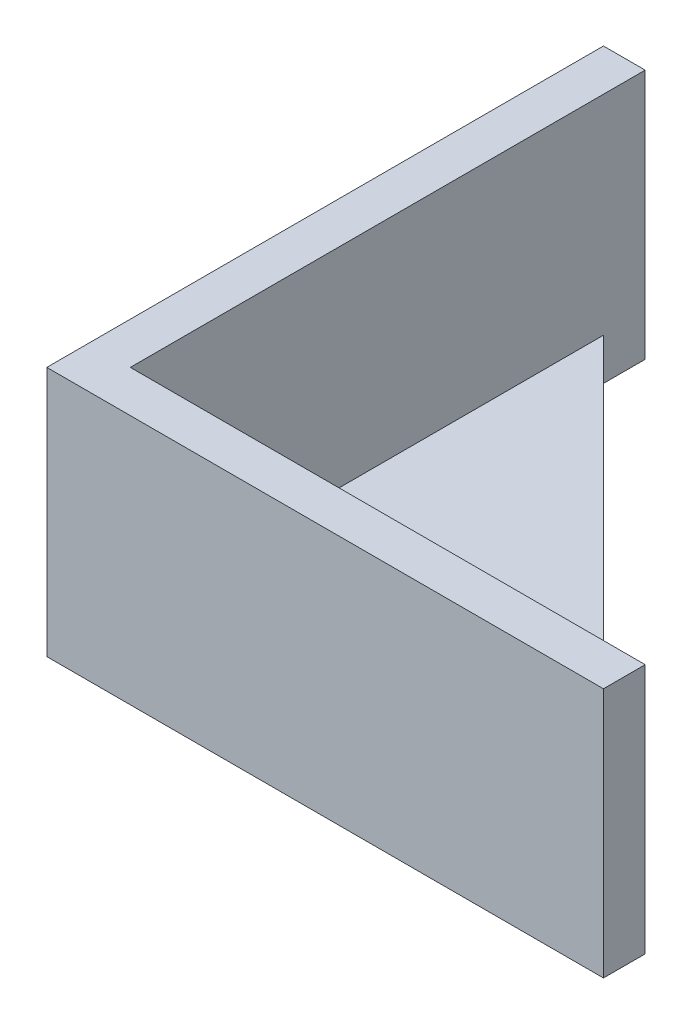
ISO-10303-21;
HEADER;
FILE_DESCRIPTION(('STEP AP214'),'2;1');
FILE_NAME('part.step','',(''),(''),'','','');
FILE_SCHEMA(('AUTOMOTIVE_DESIGN { 1 0 10303 214 1 1 1 1 }'));
ENDSEC;
DATA;
#1=APPLICATION_CONTEXT('core data for automotive mechanical design processes');
#2=APPLICATION_PROTOCOL_DEFINITION('international standard','automotive_design',2000,#1);
#3=PRODUCT_CONTEXT('',#1,'mechanical');
#4=PRODUCT('Part','Part','',(#3));
#5=PRODUCT_RELATED_PRODUCT_CATEGORY('part','',(#4));
#6=PRODUCT_DEFINITION_FORMATION('','',#4);
#7=PRODUCT_DEFINITION_CONTEXT('part definition',#1,'design');
#8=PRODUCT_DEFINITION('design','',#6,#7);
#9=PRODUCT_DEFINITION_SHAPE('','',#8);
#10=(LENGTH_UNIT() NAMED_UNIT(*) SI_UNIT(.MILLI.,.METRE.));
#11=(NAMED_UNIT(*) PLANE_ANGLE_UNIT() SI_UNIT($,.RADIAN.));
#12=(NAMED_UNIT(*) SI_UNIT($,.STERADIAN.) SOLID_ANGLE_UNIT());
#13=UNCERTAINTY_MEASURE_WITH_UNIT(LENGTH_MEASURE(1.E-05),#10,'distance_accuracy_value','');
#14=(GEOMETRIC_REPRESENTATION_CONTEXT(3) GLOBAL_UNCERTAINTY_ASSIGNED_CONTEXT((#13)) GLOBAL_UNIT_ASSIGNED_CONTEXT((#10,
#11,#12)) REPRESENTATION_CONTEXT('',''));
#15=CARTESIAN_POINT('',(0.,0.,0.));
#16=DIRECTION('',(0.,0.,1.));
#17=DIRECTION('',(1.,0.,0.));
#18=AXIS2_PLACEMENT_3D('',#15,#16,#17);
#19=CARTESIAN_POINT('',(0.,3.,0.));
#20=DIRECTION('',(0.,1.,0.));
#21=DIRECTION('',(0.,0.,1.));
#22=AXIS2_PLACEMENT_3D('',#19,#20,#21);
#23=PLANE('',#22);
#24=DIRECTION('',(0.707106781186548,0.,0.707106781186548));
#25=VECTOR('',#24,1.);
#26=CARTESIAN_POINT('',(20.,3.,-20.));
#27=LINE('',#26,#25);
#28=CARTESIAN_POINT('',(3.,3.,-37.));
#29=VERTEX_POINT('',#28);
#30=CARTESIAN_POINT('',(37.,3.,-2.99999999999999));
#31=VERTEX_POINT('',#30);
#32=EDGE_CURVE('E100',#29,#31,#27,.T.);
#33=ORIENTED_EDGE('',*,*,#32,.F.);
#34=DIRECTION('',(0.,0.,1.));
#35=VECTOR('',#34,1.);
#36=CARTESIAN_POINT('',(3.,3.,0.));
#37=LINE('',#36,#35);
#38=CARTESIAN_POINT('',(3.,3.,-2.99999999999999));
#39=VERTEX_POINT('',#38);
#40=EDGE_CURVE('E11',#29,#39,#37,.T.);
#41=ORIENTED_EDGE('',*,*,#40,.T.);
#42=DIRECTION('',(1.,0.,0.));
#43=VECTOR('',#42,1.);
#44=CARTESIAN_POINT('',(0.,3.,-3.));
#45=LINE('',#44,#43);
#46=EDGE_CURVE('E179',#39,#31,#45,.T.);
#47=ORIENTED_EDGE('',*,*,#46,.T.);
#48=EDGE_LOOP('',(#33,#41,#47));
#49=FACE_BOUND('',#48,.T.);
#50=ADVANCED_FACE('F49',(#49),#23,.T.);
#51=CARTESIAN_POINT('',(3.,3.,0.));
#52=DIRECTION('',(1.,0.,0.));
#53=DIRECTION('',(0.,0.,-1.));
#54=AXIS2_PLACEMENT_3D('',#51,#52,#53);
#55=PLANE('',#54);
#56=DIRECTION('',(0.,0.,1.));
#57=VECTOR('',#56,1.);
#58=CARTESIAN_POINT('',(3.,0.,0.));
#59=LINE('',#58,#57);
#60=CARTESIAN_POINT('',(3.,0.,-40.));
#61=VERTEX_POINT('',#60);
#62=CARTESIAN_POINT('',(3.,0.,-37.));
#63=VERTEX_POINT('',#62);
#64=EDGE_CURVE('E119',#61,#63,#59,.T.);
#65=ORIENTED_EDGE('',*,*,#64,.F.);
#66=DIRECTION('',(0.,-1.,0.));
#67=VECTOR('',#66,1.);
#68=CARTESIAN_POINT('',(3.,3.,-40.));
#69=LINE('',#68,#67);
#70=CARTESIAN_POINT('',(3.,18.,-40.));
#71=VERTEX_POINT('',#70);
#72=EDGE_CURVE('E53',#71,#61,#69,.T.);
#73=ORIENTED_EDGE('',*,*,#72,.F.);
#74=DIRECTION('',(0.,0.,1.));
#75=VECTOR('',#74,1.);
#76=CARTESIAN_POINT('',(3.,18.,0.));
#77=LINE('',#76,#75);
#78=CARTESIAN_POINT('',(3.,18.,-2.99999999999999));
#79=VERTEX_POINT('',#78);
#80=EDGE_CURVE('E186',#71,#79,#77,.T.);
#81=ORIENTED_EDGE('',*,*,#80,.T.);
#82=DIRECTION('',(0.,-1.,0.));
#83=VECTOR('',#82,1.);
#84=CARTESIAN_POINT('',(3.,18.,-2.99999999999999));
#85=LINE('',#84,#83);
#86=EDGE_CURVE('E148',#79,#39,#85,.T.);
#87=ORIENTED_EDGE('',*,*,#86,.T.);
#88=ORIENTED_EDGE('',*,*,#40,.F.);
#89=DIRECTION('',(0.,-1.,0.));
#90=VECTOR('',#89,1.);
#91=CARTESIAN_POINT('',(3.,3.,-37.));
#92=LINE('',#91,#90);
#93=EDGE_CURVE('E72',#29,#63,#92,.T.);
#94=ORIENTED_EDGE('',*,*,#93,.T.);
#95=EDGE_LOOP('',(#65,#73,#81,#87,#88,#94));
#96=FACE_BOUND('',#95,.T.);
#97=ADVANCED_FACE('F51',(#96),#55,.T.);
#98=CARTESIAN_POINT('',(0.,3.,-40.));
#99=DIRECTION('',(0.,0.,-1.));
#100=DIRECTION('',(-1.,0.,0.));
#101=AXIS2_PLACEMENT_3D('',#98,#99,#100);
#102=PLANE('',#101);
#103=DIRECTION('',(1.,0.,0.));
#104=VECTOR('',#103,1.);
#105=CARTESIAN_POINT('',(0.,0.,-40.));
#106=LINE('',#105,#104);
#107=CARTESIAN_POINT('',(0.,0.,-40.));
#108=VERTEX_POINT('',#107);
#109=EDGE_CURVE('E140',#108,#61,#106,.T.);
#110=ORIENTED_EDGE('',*,*,#109,.F.);
#111=DIRECTION('',(0.,-1.,0.));
#112=VECTOR('',#111,1.);
#113=CARTESIAN_POINT('',(0.,3.,-40.));
#114=LINE('',#113,#112);
#115=CARTESIAN_POINT('',(0.,18.,-40.));
#116=VERTEX_POINT('',#115);
#117=EDGE_CURVE('E130',#116,#108,#114,.T.);
#118=ORIENTED_EDGE('',*,*,#117,.F.);
#119=DIRECTION('',(-1.,0.,0.));
#120=VECTOR('',#119,1.);
#121=CARTESIAN_POINT('',(0.,18.,-40.));
#122=LINE('',#121,#120);
#123=EDGE_CURVE('E144',#71,#116,#122,.T.);
#124=ORIENTED_EDGE('',*,*,#123,.F.);
#125=ORIENTED_EDGE('',*,*,#72,.T.);
#126=EDGE_LOOP('',(#110,#118,#124,#125));
#127=FACE_BOUND('',#126,.T.);
#128=ADVANCED_FACE('F139',(#127),#102,.T.);
#129=CARTESIAN_POINT('',(0.,3.,0.));
#130=DIRECTION('',(-1.,0.,0.));
#131=DIRECTION('',(0.,0.,1.));
#132=AXIS2_PLACEMENT_3D('',#129,#130,#131);
#133=PLANE('',#132);
#134=DIRECTION('',(0.,0.,-1.));
#135=VECTOR('',#134,1.);
#136=CARTESIAN_POINT('',(0.,0.,0.));
#137=LINE('',#136,#135);
#138=CARTESIAN_POINT('',(0.,0.,0.));
#139=VERTEX_POINT('',#138);
#140=EDGE_CURVE('E151',#139,#108,#137,.T.);
#141=ORIENTED_EDGE('',*,*,#140,.F.);
#142=DIRECTION('',(0.,-1.,0.));
#143=VECTOR('',#142,1.);
#144=CARTESIAN_POINT('',(0.,3.,0.));
#145=LINE('',#144,#143);
#146=CARTESIAN_POINT('',(0.,18.,0.));
#147=VERTEX_POINT('',#146);
#148=EDGE_CURVE('E129',#147,#139,#145,.T.);
#149=ORIENTED_EDGE('',*,*,#148,.F.);
#150=DIRECTION('',(0.,0.,1.));
#151=VECTOR('',#150,1.);
#152=CARTESIAN_POINT('',(0.,18.,0.));
#153=LINE('',#152,#151);
#154=EDGE_CURVE('E169',#116,#147,#153,.T.);
#155=ORIENTED_EDGE('',*,*,#154,.F.);
#156=ORIENTED_EDGE('',*,*,#117,.T.);
#157=EDGE_LOOP('',(#141,#149,#155,#156));
#158=FACE_BOUND('',#157,.T.);
#159=ADVANCED_FACE('F164',(#158),#133,.T.);
#160=CARTESIAN_POINT('',(0.,3.,0.));
#161=DIRECTION('',(0.,0.,-1.));
#162=DIRECTION('',(-1.,0.,0.));
#163=AXIS2_PLACEMENT_3D('',#160,#161,#162);
#164=PLANE('',#163);
#165=DIRECTION('',(1.,0.,0.));
#166=VECTOR('',#165,1.);
#167=CARTESIAN_POINT('',(0.,0.,0.));
#168=LINE('',#167,#166);
#169=CARTESIAN_POINT('',(40.,0.,0.));
#170=VERTEX_POINT('',#169);
#171=EDGE_CURVE('E153',#139,#170,#168,.T.);
#172=ORIENTED_EDGE('',*,*,#171,.T.);
#173=DIRECTION('',(0.,-1.,0.));
#174=VECTOR('',#173,1.);
#175=CARTESIAN_POINT('',(40.,3.,0.));
#176=LINE('',#175,#174);
#177=CARTESIAN_POINT('',(40.,18.,0.));
#178=VERTEX_POINT('',#177);
#179=EDGE_CURVE('E126',#178,#170,#176,.T.);
#180=ORIENTED_EDGE('',*,*,#179,.F.);
#181=DIRECTION('',(1.,0.,0.));
#182=VECTOR('',#181,1.);
#183=CARTESIAN_POINT('',(0.,18.,0.));
#184=LINE('',#183,#182);
#185=EDGE_CURVE('E173',#147,#178,#184,.T.);
#186=ORIENTED_EDGE('',*,*,#185,.F.);
#187=ORIENTED_EDGE('',*,*,#148,.T.);
#188=EDGE_LOOP('',(#172,#180,#186,#187));
#189=FACE_BOUND('',#188,.T.);
#190=ADVANCED_FACE('F174',(#189),#164,.F.);
#191=CARTESIAN_POINT('',(40.,3.,0.));
#192=DIRECTION('',(-1.,0.,0.));
#193=DIRECTION('',(0.,0.,1.));
#194=AXIS2_PLACEMENT_3D('',#191,#192,#193);
#195=PLANE('',#194);
#196=DIRECTION('',(0.,0.,-1.));
#197=VECTOR('',#196,1.);
#198=CARTESIAN_POINT('',(40.,0.,0.));
#199=LINE('',#198,#197);
#200=CARTESIAN_POINT('',(40.,0.,-3.));
#201=VERTEX_POINT('',#200);
#202=EDGE_CURVE('E113',#170,#201,#199,.T.);
#203=ORIENTED_EDGE('',*,*,#202,.T.);
#204=DIRECTION('',(0.,-1.,0.));
#205=VECTOR('',#204,1.);
#206=CARTESIAN_POINT('',(40.,3.,-3.));
#207=LINE('',#206,#205);
#208=CARTESIAN_POINT('',(40.,18.,-3.));
#209=VERTEX_POINT('',#208);
#210=EDGE_CURVE('E103',#209,#201,#207,.T.);
#211=ORIENTED_EDGE('',*,*,#210,.F.);
#212=DIRECTION('',(0.,0.,-1.));
#213=VECTOR('',#212,1.);
#214=CARTESIAN_POINT('',(40.,18.,0.));
#215=LINE('',#214,#213);
#216=EDGE_CURVE('E176',#178,#209,#215,.T.);
#217=ORIENTED_EDGE('',*,*,#216,.F.);
#218=ORIENTED_EDGE('',*,*,#179,.T.);
#219=EDGE_LOOP('',(#203,#211,#217,#218));
#220=FACE_BOUND('',#219,.T.);
#221=ADVANCED_FACE('F157',(#220),#195,.F.);
#222=CARTESIAN_POINT('',(0.,3.,-2.99999999999999));
#223=DIRECTION('',(0.,0.,1.));
#224=DIRECTION('',(1.,0.,0.));
#225=AXIS2_PLACEMENT_3D('',#222,#223,#224);
#226=PLANE('',#225);
#227=DIRECTION('',(-1.,0.,0.));
#228=VECTOR('',#227,1.);
#229=CARTESIAN_POINT('',(0.,0.,-2.99999999999999));
#230=LINE('',#229,#228);
#231=CARTESIAN_POINT('',(37.,0.,-3.));
#232=VERTEX_POINT('',#231);
#233=EDGE_CURVE('E107',#201,#232,#230,.T.);
#234=ORIENTED_EDGE('',*,*,#233,.T.);
#235=DIRECTION('',(0.,-1.,0.));
#236=VECTOR('',#235,1.);
#237=CARTESIAN_POINT('',(37.,3.,-3.));
#238=LINE('',#237,#236);
#239=EDGE_CURVE('E95',#31,#232,#238,.T.);
#240=ORIENTED_EDGE('',*,*,#239,.F.);
#241=ORIENTED_EDGE('',*,*,#46,.F.);
#242=ORIENTED_EDGE('',*,*,#86,.F.);
#243=DIRECTION('',(1.,0.,0.));
#244=VECTOR('',#243,1.);
#245=CARTESIAN_POINT('',(0.,18.,-3.));
#246=LINE('',#245,#244);
#247=EDGE_CURVE('E184',#79,#209,#246,.T.);
#248=ORIENTED_EDGE('',*,*,#247,.T.);
#249=ORIENTED_EDGE('',*,*,#210,.T.);
#250=EDGE_LOOP('',(#234,#240,#241,#242,#248,#249));
#251=FACE_BOUND('',#250,.T.);
#252=ADVANCED_FACE('F108',(#251),#226,.F.);
#253=CARTESIAN_POINT('',(20.,3.,-20.));
#254=DIRECTION('',(0.707106781186547,0.,-0.707106781186547));
#255=DIRECTION('',(-0.707106781186548,0.,-0.707106781186548));
#256=AXIS2_PLACEMENT_3D('',#253,#254,#255);
#257=PLANE('',#256);
#258=DIRECTION('',(0.707106781186548,0.,0.707106781186548));
#259=VECTOR('',#258,1.);
#260=CARTESIAN_POINT('',(20.,0.,-20.));
#261=LINE('',#260,#259);
#262=EDGE_CURVE('E99',#63,#232,#261,.T.);
#263=ORIENTED_EDGE('',*,*,#262,.F.);
#264=ORIENTED_EDGE('',*,*,#93,.F.);
#265=ORIENTED_EDGE('',*,*,#32,.T.);
#266=ORIENTED_EDGE('',*,*,#239,.T.);
#267=EDGE_LOOP('',(#263,#264,#265,#266));
#268=FACE_BOUND('',#267,.T.);
#269=ADVANCED_FACE('F97',(#268),#257,.T.);
#270=CARTESIAN_POINT('',(0.,0.,0.));
#271=DIRECTION('',(0.,1.,0.));
#272=DIRECTION('',(0.,0.,1.));
#273=AXIS2_PLACEMENT_3D('',#270,#271,#272);
#274=PLANE('',#273);
#275=ORIENTED_EDGE('',*,*,#64,.T.);
#276=ORIENTED_EDGE('',*,*,#262,.T.);
#277=ORIENTED_EDGE('',*,*,#233,.F.);
#278=ORIENTED_EDGE('',*,*,#202,.F.);
#279=ORIENTED_EDGE('',*,*,#171,.F.);
#280=ORIENTED_EDGE('',*,*,#140,.T.);
#281=ORIENTED_EDGE('',*,*,#109,.T.);
#282=EDGE_LOOP('',(#275,#276,#277,#278,#279,#280,#281));
#283=FACE_BOUND('',#282,.T.);
#284=ADVANCED_FACE('F116',(#283),#274,.F.);
#285=CARTESIAN_POINT('',(0.,18.,0.));
#286=DIRECTION('',(0.,1.,0.));
#287=DIRECTION('',(0.,0.,1.));
#288=AXIS2_PLACEMENT_3D('',#285,#286,#287);
#289=PLANE('',#288);
#290=ORIENTED_EDGE('',*,*,#154,.T.);
#291=ORIENTED_EDGE('',*,*,#185,.T.);
#292=ORIENTED_EDGE('',*,*,#216,.T.);
#293=ORIENTED_EDGE('',*,*,#247,.F.);
#294=ORIENTED_EDGE('',*,*,#80,.F.);
#295=ORIENTED_EDGE('',*,*,#123,.T.);
#296=EDGE_LOOP('',(#290,#291,#292,#293,#294,#295));
#297=FACE_BOUND('',#296,.T.);
#298=ADVANCED_FACE('F178',(#297),#289,.T.);
#299=CLOSED_SHELL('',(#50,#97,#128,#159,#190,#221,#252,#269,#284,#298));
#300=MANIFOLD_SOLID_BREP('B2',#299);
#301=ADVANCED_BREP_SHAPE_REPRESENTATION('',(#18,#300),#14);
#302=SHAPE_DEFINITION_REPRESENTATION(#9,#301);
ENDSEC;
END-ISO-10303-21;
